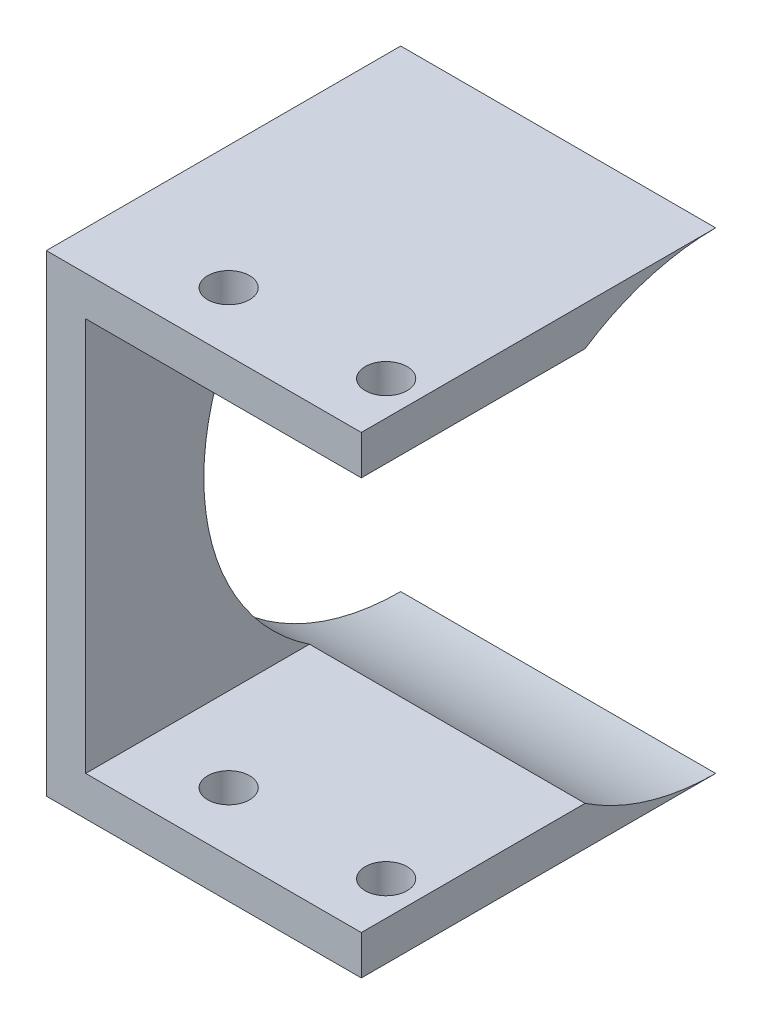
ISO-10303-21;
HEADER;
FILE_DESCRIPTION(('STEP AP214'),'2;1');
FILE_NAME('part.step','',(''),(''),'','','');
FILE_SCHEMA(('AUTOMOTIVE_DESIGN { 1 0 10303 214 1 1 1 1 }'));
ENDSEC;
DATA;
#1=APPLICATION_CONTEXT('core data for automotive mechanical design processes');
#2=APPLICATION_PROTOCOL_DEFINITION('international standard','automotive_design',2000,#1);
#3=PRODUCT_CONTEXT('',#1,'mechanical');
#4=PRODUCT('Part','Part','',(#3));
#5=PRODUCT_RELATED_PRODUCT_CATEGORY('part','',(#4));
#6=PRODUCT_DEFINITION_FORMATION('','',#4);
#7=PRODUCT_DEFINITION_CONTEXT('part definition',#1,'design');
#8=PRODUCT_DEFINITION('design','',#6,#7);
#9=PRODUCT_DEFINITION_SHAPE('','',#8);
#10=(LENGTH_UNIT() NAMED_UNIT(*) SI_UNIT(.MILLI.,.METRE.));
#11=(NAMED_UNIT(*) PLANE_ANGLE_UNIT() SI_UNIT($,.RADIAN.));
#12=(NAMED_UNIT(*) SI_UNIT($,.STERADIAN.) SOLID_ANGLE_UNIT());
#13=UNCERTAINTY_MEASURE_WITH_UNIT(LENGTH_MEASURE(1.E-05),#10,'distance_accuracy_value','');
#14=(GEOMETRIC_REPRESENTATION_CONTEXT(3) GLOBAL_UNCERTAINTY_ASSIGNED_CONTEXT((#13)) GLOBAL_UNIT_ASSIGNED_CONTEXT((#10,
#11,#12)) REPRESENTATION_CONTEXT('',''));
#15=CARTESIAN_POINT('',(0.,0.,0.));
#16=DIRECTION('',(0.,0.,1.));
#17=DIRECTION('',(1.,0.,0.));
#18=AXIS2_PLACEMENT_3D('',#15,#16,#17);
#19=CARTESIAN_POINT('',(50.8,0.,57.15));
#20=DIRECTION('',(-1.,0.,0.));
#21=DIRECTION('',(0.,0.,1.));
#22=AXIS2_PLACEMENT_3D('',#19,#20,#21);
#23=PLANE('',#22);
#24=DIRECTION('',(0.,0.,-1.));
#25=VECTOR('',#24,1.);
#26=CARTESIAN_POINT('',(50.8,6.35,57.15));
#27=LINE('',#26,#25);
#28=CARTESIAN_POINT('',(50.8,6.35,57.15));
#29=VERTEX_POINT('',#28);
#30=CARTESIAN_POINT('',(50.8,6.35,21.0605674187568));
#31=VERTEX_POINT('',#30);
#32=EDGE_CURVE('E107',#29,#31,#27,.T.);
#33=ORIENTED_EDGE('',*,*,#32,.F.);
#34=DIRECTION('',(0.,1.,0.));
#35=VECTOR('',#34,1.);
#36=CARTESIAN_POINT('',(50.8,0.,57.15));
#37=LINE('',#36,#35);
#38=CARTESIAN_POINT('',(50.8,0.,57.15));
#39=VERTEX_POINT('',#38);
#40=EDGE_CURVE('E93',#39,#29,#37,.T.);
#41=ORIENTED_EDGE('',*,*,#40,.F.);
#42=DIRECTION('',(0.,0.,-1.));
#43=VECTOR('',#42,1.);
#44=CARTESIAN_POINT('',(50.8,0.,57.15));
#45=LINE('',#44,#43);
#46=CARTESIAN_POINT('',(50.8,0.,0.));
#47=VERTEX_POINT('',#46);
#48=EDGE_CURVE('E44',#39,#47,#45,.T.);
#49=ORIENTED_EDGE('',*,*,#48,.T.);
#50=CARTESIAN_POINT('',(50.8,38.1,0.));
#51=DIRECTION('',(1.,0.,0.));
#52=DIRECTION('',(0.,0.,-1.));
#53=AXIS2_PLACEMENT_3D('',#50,#51,#52);
#54=CIRCLE('',#53,38.1);
#55=EDGE_CURVE('E73',#31,#47,#54,.T.);
#56=ORIENTED_EDGE('',*,*,#55,.F.);
#57=EDGE_LOOP('',(#33,#41,#49,#56));
#58=FACE_BOUND('',#57,.T.);
#59=ADVANCED_FACE('F35',(#58),#23,.F.);
#60=CARTESIAN_POINT('',(0.,0.,57.15));
#61=DIRECTION('',(0.,0.,-1.));
#62=DIRECTION('',(-1.,0.,0.));
#63=AXIS2_PLACEMENT_3D('',#60,#61,#62);
#64=PLANE('',#63);
#65=DIRECTION('',(1.,0.,0.));
#66=VECTOR('',#65,1.);
#67=CARTESIAN_POINT('',(0.,6.35,57.15));
#68=LINE('',#67,#66);
#69=CARTESIAN_POINT('',(6.35,6.35,57.15));
#70=VERTEX_POINT('',#69);
#71=EDGE_CURVE('E146',#70,#29,#68,.T.);
#72=ORIENTED_EDGE('',*,*,#71,.F.);
#73=DIRECTION('',(0.,-1.,0.));
#74=VECTOR('',#73,1.);
#75=CARTESIAN_POINT('',(6.35,0.,57.15));
#76=LINE('',#75,#74);
#77=CARTESIAN_POINT('',(6.35,69.85,57.15));
#78=VERTEX_POINT('',#77);
#79=EDGE_CURVE('E150',#78,#70,#76,.T.);
#80=ORIENTED_EDGE('',*,*,#79,.F.);
#81=DIRECTION('',(-1.,0.,0.));
#82=VECTOR('',#81,1.);
#83=CARTESIAN_POINT('',(0.,69.85,57.15));
#84=LINE('',#83,#82);
#85=CARTESIAN_POINT('',(50.8,69.85,57.15));
#86=VERTEX_POINT('',#85);
#87=EDGE_CURVE('E149',#86,#78,#84,.T.);
#88=ORIENTED_EDGE('',*,*,#87,.F.);
#89=CARTESIAN_POINT('',(50.8,76.2,57.15));
#90=VERTEX_POINT('',#89);
#91=EDGE_CURVE('E98',#86,#90,#37,.T.);
#92=ORIENTED_EDGE('',*,*,#91,.T.);
#93=DIRECTION('',(-1.,0.,0.));
#94=VECTOR('',#93,1.);
#95=CARTESIAN_POINT('',(0.,76.2,57.15));
#96=LINE('',#95,#94);
#97=CARTESIAN_POINT('',(0.,76.2,57.15));
#98=VERTEX_POINT('',#97);
#99=EDGE_CURVE('E60',#90,#98,#96,.T.);
#100=ORIENTED_EDGE('',*,*,#99,.T.);
#101=DIRECTION('',(0.,-1.,0.));
#102=VECTOR('',#101,1.);
#103=CARTESIAN_POINT('',(0.,0.,57.15));
#104=LINE('',#103,#102);
#105=CARTESIAN_POINT('',(0.,0.,57.15));
#106=VERTEX_POINT('',#105);
#107=EDGE_CURVE('E95',#98,#106,#104,.T.);
#108=ORIENTED_EDGE('',*,*,#107,.T.);
#109=DIRECTION('',(1.,0.,0.));
#110=VECTOR('',#109,1.);
#111=CARTESIAN_POINT('',(0.,0.,57.15));
#112=LINE('',#111,#110);
#113=EDGE_CURVE('E87',#106,#39,#112,.T.);
#114=ORIENTED_EDGE('',*,*,#113,.T.);
#115=ORIENTED_EDGE('',*,*,#40,.T.);
#116=EDGE_LOOP('',(#72,#80,#88,#92,#100,#108,#114,#115));
#117=FACE_BOUND('',#116,.T.);
#118=ADVANCED_FACE('F90',(#117),#64,.F.);
#119=CARTESIAN_POINT('',(0.,0.,57.15));
#120=DIRECTION('',(1.,0.,0.));
#121=DIRECTION('',(0.,0.,-1.));
#122=AXIS2_PLACEMENT_3D('',#119,#120,#121);
#123=PLANE('',#122);
#124=DIRECTION('',(0.,0.,-1.));
#125=VECTOR('',#124,1.);
#126=CARTESIAN_POINT('',(0.,76.2,57.15));
#127=LINE('',#126,#125);
#128=CARTESIAN_POINT('',(0.,76.2,0.));
#129=VERTEX_POINT('',#128);
#130=EDGE_CURVE('E109',#98,#129,#127,.T.);
#131=ORIENTED_EDGE('',*,*,#130,.T.);
#132=CARTESIAN_POINT('',(0.,38.1,0.));
#133=DIRECTION('',(1.,0.,0.));
#134=DIRECTION('',(0.,0.,-1.));
#135=AXIS2_PLACEMENT_3D('',#132,#133,#134);
#136=CIRCLE('',#135,38.1);
#137=CARTESIAN_POINT('',(0.,0.,0.));
#138=VERTEX_POINT('',#137);
#139=EDGE_CURVE('E115',#129,#138,#136,.T.);
#140=ORIENTED_EDGE('',*,*,#139,.T.);
#141=DIRECTION('',(0.,0.,-1.));
#142=VECTOR('',#141,1.);
#143=CARTESIAN_POINT('',(0.,0.,57.15));
#144=LINE('',#143,#142);
#145=EDGE_CURVE('E11',#106,#138,#144,.T.);
#146=ORIENTED_EDGE('',*,*,#145,.F.);
#147=ORIENTED_EDGE('',*,*,#107,.F.);
#148=EDGE_LOOP('',(#131,#140,#146,#147));
#149=FACE_BOUND('',#148,.T.);
#150=ADVANCED_FACE('F37',(#149),#123,.F.);
#151=CARTESIAN_POINT('',(0.,0.,57.15));
#152=DIRECTION('',(0.,1.,0.));
#153=DIRECTION('',(0.,0.,1.));
#154=AXIS2_PLACEMENT_3D('',#151,#152,#153);
#155=PLANE('',#154);
#156=CARTESIAN_POINT('',(45.28185,0.,47.625));
#157=DIRECTION('',(0.,1.,0.));
#158=DIRECTION('',(0.,0.,1.));
#159=AXIS2_PLACEMENT_3D('',#156,#157,#158);
#160=CIRCLE('',#159,3.37819999999998);
#161=CARTESIAN_POINT('',(45.28185,0.,51.0032));
#162=VERTEX_POINT('',#161);
#163=EDGE_CURVE('E177',#162,#162,#160,.T.);
#164=ORIENTED_EDGE('',*,*,#163,.T.);
#165=EDGE_LOOP('',(#164));
#166=FACE_BOUND('',#165,.T.);
#167=CARTESIAN_POINT('',(19.88185,0.,47.625));
#168=DIRECTION('',(0.,1.,0.));
#169=DIRECTION('',(0.,0.,1.));
#170=AXIS2_PLACEMENT_3D('',#167,#168,#169);
#171=CIRCLE('',#170,3.37819999999998);
#172=CARTESIAN_POINT('',(19.88185,0.,51.0032));
#173=VERTEX_POINT('',#172);
#174=EDGE_CURVE('E168',#173,#173,#171,.T.);
#175=ORIENTED_EDGE('',*,*,#174,.T.);
#176=EDGE_LOOP('',(#175));
#177=FACE_BOUND('',#176,.T.);
#178=DIRECTION('',(1.,0.,0.));
#179=VECTOR('',#178,1.);
#180=CARTESIAN_POINT('',(0.,0.,0.));
#181=LINE('',#180,#179);
#182=EDGE_CURVE('E80',#138,#47,#181,.T.);
#183=ORIENTED_EDGE('',*,*,#182,.T.);
#184=ORIENTED_EDGE('',*,*,#48,.F.);
#185=ORIENTED_EDGE('',*,*,#113,.F.);
#186=ORIENTED_EDGE('',*,*,#145,.T.);
#187=EDGE_LOOP('',(#183,#184,#185,#186));
#188=FACE_BOUND('',#187,.T.);
#189=ADVANCED_FACE('F101',(#166,#177,#188),#155,.F.);
#190=ORIENTED_EDGE('',*,*,#91,.F.);
#191=DIRECTION('',(0.,0.,-1.));
#192=VECTOR('',#191,1.);
#193=CARTESIAN_POINT('',(50.8,69.85,57.15));
#194=LINE('',#193,#192);
#195=CARTESIAN_POINT('',(50.8,69.85,21.0605674187568));
#196=VERTEX_POINT('',#195);
#197=EDGE_CURVE('E136',#86,#196,#194,.T.);
#198=ORIENTED_EDGE('',*,*,#197,.T.);
#199=CARTESIAN_POINT('',(50.8,76.2,0.));
#200=VERTEX_POINT('',#199);
#201=EDGE_CURVE('E133',#200,#196,#54,.T.);
#202=ORIENTED_EDGE('',*,*,#201,.F.);
#203=DIRECTION('',(0.,0.,-1.));
#204=VECTOR('',#203,1.);
#205=CARTESIAN_POINT('',(50.8,76.2,57.15));
#206=LINE('',#205,#204);
#207=EDGE_CURVE('E103',#90,#200,#206,.T.);
#208=ORIENTED_EDGE('',*,*,#207,.F.);
#209=EDGE_LOOP('',(#190,#198,#202,#208));
#210=FACE_BOUND('',#209,.T.);
#211=ADVANCED_FACE('F129',(#210),#23,.F.);
#212=CARTESIAN_POINT('',(0.,76.2,57.15));
#213=DIRECTION('',(0.,-1.,0.));
#214=DIRECTION('',(0.,0.,-1.));
#215=AXIS2_PLACEMENT_3D('',#212,#213,#214);
#216=PLANE('',#215);
#217=CARTESIAN_POINT('',(45.28185,76.2,47.625));
#218=DIRECTION('',(0.,1.,0.));
#219=DIRECTION('',(0.,0.,1.));
#220=AXIS2_PLACEMENT_3D('',#217,#218,#219);
#221=CIRCLE('',#220,3.3782);
#222=CARTESIAN_POINT('',(45.28185,76.2,51.0032));
#223=VERTEX_POINT('',#222);
#224=EDGE_CURVE('E180',#223,#223,#221,.T.);
#225=ORIENTED_EDGE('',*,*,#224,.F.);
#226=EDGE_LOOP('',(#225));
#227=FACE_BOUND('',#226,.T.);
#228=CARTESIAN_POINT('',(19.88185,76.2,47.625));
#229=DIRECTION('',(0.,1.,0.));
#230=DIRECTION('',(0.,0.,1.));
#231=AXIS2_PLACEMENT_3D('',#228,#229,#230);
#232=CIRCLE('',#231,3.37819999999999);
#233=CARTESIAN_POINT('',(19.88185,76.2,51.0032));
#234=VERTEX_POINT('',#233);
#235=EDGE_CURVE('E171',#234,#234,#232,.T.);
#236=ORIENTED_EDGE('',*,*,#235,.F.);
#237=EDGE_LOOP('',(#236));
#238=FACE_BOUND('',#237,.T.);
#239=DIRECTION('',(-1.,0.,0.));
#240=VECTOR('',#239,1.);
#241=CARTESIAN_POINT('',(0.,76.2,0.));
#242=LINE('',#241,#240);
#243=EDGE_CURVE('E114',#200,#129,#242,.T.);
#244=ORIENTED_EDGE('',*,*,#243,.T.);
#245=ORIENTED_EDGE('',*,*,#130,.F.);
#246=ORIENTED_EDGE('',*,*,#99,.F.);
#247=ORIENTED_EDGE('',*,*,#207,.T.);
#248=EDGE_LOOP('',(#244,#245,#246,#247));
#249=FACE_BOUND('',#248,.T.);
#250=ADVANCED_FACE('F123',(#227,#238,#249),#216,.F.);
#251=CARTESIAN_POINT('',(0.,38.1,0.));
#252=DIRECTION('',(1.,0.,0.));
#253=DIRECTION('',(0.,0.,-1.));
#254=AXIS2_PLACEMENT_3D('',#251,#252,#253);
#255=CYLINDRICAL_SURFACE('',#254,38.1);
#256=ORIENTED_EDGE('',*,*,#201,.T.);
#257=DIRECTION('',(1.,0.,0.));
#258=VECTOR('',#257,1.);
#259=CARTESIAN_POINT('',(0.,69.85,21.0605674187568));
#260=LINE('',#259,#258);
#261=CARTESIAN_POINT('',(6.35,69.85,21.0605674187568));
#262=VERTEX_POINT('',#261);
#263=EDGE_CURVE('E143',#196,#262,#260,.F.);
#264=ORIENTED_EDGE('',*,*,#263,.T.);
#265=CARTESIAN_POINT('',(6.35,38.1,0.));
#266=DIRECTION('',(1.,0.,0.));
#267=DIRECTION('',(0.,0.,-1.));
#268=AXIS2_PLACEMENT_3D('',#265,#266,#267);
#269=CIRCLE('',#268,38.1);
#270=CARTESIAN_POINT('',(6.35,6.35,21.0605674187568));
#271=VERTEX_POINT('',#270);
#272=EDGE_CURVE('E144',#262,#271,#269,.T.);
#273=ORIENTED_EDGE('',*,*,#272,.T.);
#274=DIRECTION('',(1.,0.,0.));
#275=VECTOR('',#274,1.);
#276=CARTESIAN_POINT('',(25.4,6.35,21.0605674187568));
#277=LINE('',#276,#275);
#278=EDGE_CURVE('E141',#271,#31,#277,.T.);
#279=ORIENTED_EDGE('',*,*,#278,.T.);
#280=ORIENTED_EDGE('',*,*,#55,.T.);
#281=ORIENTED_EDGE('',*,*,#182,.F.);
#282=ORIENTED_EDGE('',*,*,#139,.F.);
#283=ORIENTED_EDGE('',*,*,#243,.F.);
#284=EDGE_LOOP('',(#256,#264,#273,#279,#280,#281,#282,#283));
#285=FACE_BOUND('',#284,.T.);
#286=ADVANCED_FACE('F188',(#285),#255,.F.);
#287=CARTESIAN_POINT('',(6.35,0.,57.15));
#288=DIRECTION('',(1.,0.,0.));
#289=DIRECTION('',(0.,0.,-1.));
#290=AXIS2_PLACEMENT_3D('',#287,#288,#289);
#291=PLANE('',#290);
#292=DIRECTION('',(0.,0.,-1.));
#293=VECTOR('',#292,1.);
#294=CARTESIAN_POINT('',(6.35,69.85,57.15));
#295=LINE('',#294,#293);
#296=EDGE_CURVE('E154',#78,#262,#295,.T.);
#297=ORIENTED_EDGE('',*,*,#296,.F.);
#298=ORIENTED_EDGE('',*,*,#79,.T.);
#299=DIRECTION('',(0.,0.,-1.));
#300=VECTOR('',#299,1.);
#301=CARTESIAN_POINT('',(6.35,6.35,57.15));
#302=LINE('',#301,#300);
#303=EDGE_CURVE('E51',#70,#271,#302,.T.);
#304=ORIENTED_EDGE('',*,*,#303,.T.);
#305=ORIENTED_EDGE('',*,*,#272,.F.);
#306=EDGE_LOOP('',(#297,#298,#304,#305));
#307=FACE_BOUND('',#306,.T.);
#308=ADVANCED_FACE('F230',(#307),#291,.T.);
#309=CARTESIAN_POINT('',(0.,6.35,57.15));
#310=DIRECTION('',(0.,1.,0.));
#311=DIRECTION('',(0.,0.,1.));
#312=AXIS2_PLACEMENT_3D('',#309,#310,#311);
#313=PLANE('',#312);
#314=CARTESIAN_POINT('',(45.28185,6.34999999999999,47.625));
#315=DIRECTION('',(0.,1.,0.));
#316=DIRECTION('',(0.,0.,1.));
#317=AXIS2_PLACEMENT_3D('',#314,#315,#316);
#318=CIRCLE('',#317,3.37819999999999);
#319=CARTESIAN_POINT('',(45.28185,6.34999999999999,51.0032));
#320=VERTEX_POINT('',#319);
#321=EDGE_CURVE('E39',#320,#320,#318,.T.);
#322=ORIENTED_EDGE('',*,*,#321,.F.);
#323=EDGE_LOOP('',(#322));
#324=FACE_BOUND('',#323,.T.);
#325=CARTESIAN_POINT('',(19.88185,6.34999999999999,47.625));
#326=DIRECTION('',(0.,1.,0.));
#327=DIRECTION('',(0.,0.,1.));
#328=AXIS2_PLACEMENT_3D('',#325,#326,#327);
#329=CIRCLE('',#328,3.37819999999999);
#330=CARTESIAN_POINT('',(19.88185,6.34999999999999,51.0032));
#331=VERTEX_POINT('',#330);
#332=EDGE_CURVE('E159',#331,#331,#329,.T.);
#333=ORIENTED_EDGE('',*,*,#332,.F.);
#334=EDGE_LOOP('',(#333));
#335=FACE_BOUND('',#334,.T.);
#336=ORIENTED_EDGE('',*,*,#278,.F.);
#337=ORIENTED_EDGE('',*,*,#303,.F.);
#338=ORIENTED_EDGE('',*,*,#71,.T.);
#339=ORIENTED_EDGE('',*,*,#32,.T.);
#340=EDGE_LOOP('',(#336,#337,#338,#339));
#341=FACE_BOUND('',#340,.T.);
#342=ADVANCED_FACE('F235',(#324,#335,#341),#313,.T.);
#343=CARTESIAN_POINT('',(0.,69.85,57.15));
#344=DIRECTION('',(0.,-1.,0.));
#345=DIRECTION('',(0.,0.,-1.));
#346=AXIS2_PLACEMENT_3D('',#343,#344,#345);
#347=PLANE('',#346);
#348=CARTESIAN_POINT('',(45.28185,69.85,47.625));
#349=DIRECTION('',(0.,-1.,0.));
#350=DIRECTION('',(0.,0.,-1.));
#351=AXIS2_PLACEMENT_3D('',#348,#349,#350);
#352=CIRCLE('',#351,3.37819999999999);
#353=CARTESIAN_POINT('',(45.28185,69.85,44.2468));
#354=VERTEX_POINT('',#353);
#355=EDGE_CURVE('E174',#354,#354,#352,.T.);
#356=ORIENTED_EDGE('',*,*,#355,.F.);
#357=EDGE_LOOP('',(#356));
#358=FACE_BOUND('',#357,.T.);
#359=CARTESIAN_POINT('',(19.88185,69.85,47.625));
#360=DIRECTION('',(0.,-1.,0.));
#361=DIRECTION('',(0.,0.,-1.));
#362=AXIS2_PLACEMENT_3D('',#359,#360,#361);
#363=CIRCLE('',#362,3.37819999999999);
#364=CARTESIAN_POINT('',(19.88185,69.85,44.2468));
#365=VERTEX_POINT('',#364);
#366=EDGE_CURVE('E165',#365,#365,#363,.T.);
#367=ORIENTED_EDGE('',*,*,#366,.F.);
#368=EDGE_LOOP('',(#367));
#369=FACE_BOUND('',#368,.T.);
#370=ORIENTED_EDGE('',*,*,#263,.F.);
#371=ORIENTED_EDGE('',*,*,#197,.F.);
#372=ORIENTED_EDGE('',*,*,#87,.T.);
#373=ORIENTED_EDGE('',*,*,#296,.T.);
#374=EDGE_LOOP('',(#370,#371,#372,#373));
#375=FACE_BOUND('',#374,.T.);
#376=ADVANCED_FACE('F204',(#358,#369,#375),#347,.T.);
#377=CARTESIAN_POINT('',(19.88185,76.2,47.625));
#378=DIRECTION('',(0.,1.,0.));
#379=DIRECTION('',(0.,0.,1.));
#380=AXIS2_PLACEMENT_3D('',#377,#378,#379);
#381=CYLINDRICAL_SURFACE('',#380,3.37819999999999);
#382=ORIENTED_EDGE('',*,*,#332,.T.);
#383=EDGE_LOOP('',(#382));
#384=FACE_BOUND('',#383,.T.);
#385=ORIENTED_EDGE('',*,*,#174,.F.);
#386=EDGE_LOOP('',(#385));
#387=FACE_BOUND('',#386,.T.);
#388=ADVANCED_FACE('F195',(#384,#387),#381,.F.);
#389=ORIENTED_EDGE('',*,*,#366,.T.);
#390=EDGE_LOOP('',(#389));
#391=FACE_BOUND('',#390,.T.);
#392=ORIENTED_EDGE('',*,*,#235,.T.);
#393=EDGE_LOOP('',(#392));
#394=FACE_BOUND('',#393,.T.);
#395=ADVANCED_FACE('F192',(#391,#394),#381,.F.);
#396=CARTESIAN_POINT('',(45.28185,76.2,47.625));
#397=DIRECTION('',(0.,1.,0.));
#398=DIRECTION('',(0.,0.,1.));
#399=AXIS2_PLACEMENT_3D('',#396,#397,#398);
#400=CYLINDRICAL_SURFACE('',#399,3.37819999999999);
#401=ORIENTED_EDGE('',*,*,#321,.T.);
#402=EDGE_LOOP('',(#401));
#403=FACE_BOUND('',#402,.T.);
#404=ORIENTED_EDGE('',*,*,#163,.F.);
#405=EDGE_LOOP('',(#404));
#406=FACE_BOUND('',#405,.T.);
#407=ADVANCED_FACE('F194',(#403,#406),#400,.F.);
#408=ORIENTED_EDGE('',*,*,#355,.T.);
#409=EDGE_LOOP('',(#408));
#410=FACE_BOUND('',#409,.T.);
#411=ORIENTED_EDGE('',*,*,#224,.T.);
#412=EDGE_LOOP('',(#411));
#413=FACE_BOUND('',#412,.T.);
#414=ADVANCED_FACE('F184',(#410,#413),#400,.F.);
#415=CLOSED_SHELL('',(#59,#118,#150,#189,#211,#250,#286,#308,#342,#376,#388,#395,#407,#414));
#416=MANIFOLD_SOLID_BREP('B2',#415);
#417=ADVANCED_BREP_SHAPE_REPRESENTATION('',(#18,#416),#14);
#418=SHAPE_DEFINITION_REPRESENTATION(#9,#417);
ENDSEC;
END-ISO-10303-21;
